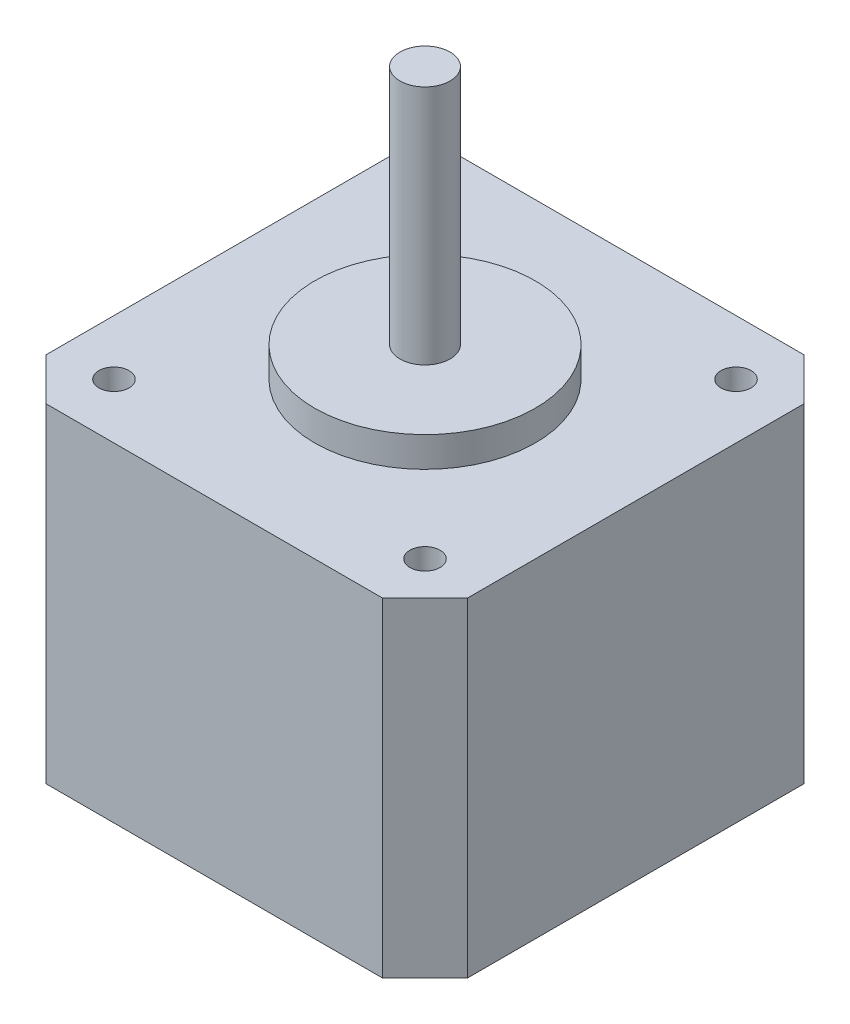
ISO-10303-21;
HEADER;
FILE_DESCRIPTION(('STEP AP214'),'2;1');
FILE_NAME('part.step','',(''),(''),'','','');
FILE_SCHEMA(('AUTOMOTIVE_DESIGN { 1 0 10303 214 1 1 1 1 }'));
ENDSEC;
DATA;
#1=APPLICATION_CONTEXT('core data for automotive mechanical design processes');
#2=APPLICATION_PROTOCOL_DEFINITION('international standard','automotive_design',2000,#1);
#3=PRODUCT_CONTEXT('',#1,'mechanical');
#4=PRODUCT('Part','Part','',(#3));
#5=PRODUCT_RELATED_PRODUCT_CATEGORY('part','',(#4));
#6=PRODUCT_DEFINITION_FORMATION('','',#4);
#7=PRODUCT_DEFINITION_CONTEXT('part definition',#1,'design');
#8=PRODUCT_DEFINITION('design','',#6,#7);
#9=PRODUCT_DEFINITION_SHAPE('','',#8);
#10=(LENGTH_UNIT() NAMED_UNIT(*) SI_UNIT(.MILLI.,.METRE.));
#11=(NAMED_UNIT(*) PLANE_ANGLE_UNIT() SI_UNIT($,.RADIAN.));
#12=(NAMED_UNIT(*) SI_UNIT($,.STERADIAN.) SOLID_ANGLE_UNIT());
#13=UNCERTAINTY_MEASURE_WITH_UNIT(LENGTH_MEASURE(1.E-05),#10,'distance_accuracy_value','');
#14=(GEOMETRIC_REPRESENTATION_CONTEXT(3) GLOBAL_UNCERTAINTY_ASSIGNED_CONTEXT((#13)) GLOBAL_UNIT_ASSIGNED_CONTEXT((#10,
#11,#12)) REPRESENTATION_CONTEXT('',''));
#15=CARTESIAN_POINT('',(0.,0.,0.));
#16=DIRECTION('',(0.,0.,1.));
#17=DIRECTION('',(1.,0.,0.));
#18=AXIS2_PLACEMENT_3D('',#15,#16,#17);
#19=CARTESIAN_POINT('',(-21.,32.8,-19.));
#20=DIRECTION('',(1.,0.,0.));
#21=DIRECTION('',(0.,0.,-1.));
#22=AXIS2_PLACEMENT_3D('',#19,#20,#21);
#23=PLANE('',#22);
#24=DIRECTION('',(0.,0.,1.));
#25=VECTOR('',#24,1.);
#26=CARTESIAN_POINT('',(-21.,0.,-19.));
#27=LINE('',#26,#25);
#28=CARTESIAN_POINT('',(-21.,0.,-19.));
#29=VERTEX_POINT('',#28);
#30=CARTESIAN_POINT('',(-21.,0.,16.76));
#31=VERTEX_POINT('',#30);
#32=EDGE_CURVE('E131',#29,#31,#27,.T.);
#33=ORIENTED_EDGE('',*,*,#32,.T.);
#34=DIRECTION('',(0.,-1.,0.));
#35=VECTOR('',#34,1.);
#36=CARTESIAN_POINT('',(-21.,32.8,16.76));
#37=LINE('',#36,#35);
#38=CARTESIAN_POINT('',(-21.,32.8,16.76));
#39=VERTEX_POINT('',#38);
#40=EDGE_CURVE('E35',#39,#31,#37,.T.);
#41=ORIENTED_EDGE('',*,*,#40,.F.);
#42=DIRECTION('',(0.,0.,1.));
#43=VECTOR('',#42,1.);
#44=CARTESIAN_POINT('',(-21.,32.8,-19.));
#45=LINE('',#44,#43);
#46=CARTESIAN_POINT('',(-21.,32.8,-19.));
#47=VERTEX_POINT('',#46);
#48=EDGE_CURVE('E146',#47,#39,#45,.T.);
#49=ORIENTED_EDGE('',*,*,#48,.F.);
#50=DIRECTION('',(0.,-1.,0.));
#51=VECTOR('',#50,1.);
#52=CARTESIAN_POINT('',(-21.,32.8,-19.));
#53=LINE('',#52,#51);
#54=EDGE_CURVE('E127',#47,#29,#53,.T.);
#55=ORIENTED_EDGE('',*,*,#54,.T.);
#56=EDGE_LOOP('',(#33,#41,#49,#55));
#57=FACE_BOUND('',#56,.T.);
#58=ADVANCED_FACE('F32',(#57),#23,.F.);
#59=CARTESIAN_POINT('',(-21.,32.8,16.76));
#60=DIRECTION('',(0.707106781186552,0.,-0.707106781186543));
#61=DIRECTION('',(-0.707106781186543,0.,-0.707106781186552));
#62=AXIS2_PLACEMENT_3D('',#59,#60,#61);
#63=PLANE('',#62);
#64=DIRECTION('',(0.707106781186543,0.,0.707106781186552));
#65=VECTOR('',#64,1.);
#66=CARTESIAN_POINT('',(-21.,0.,16.76));
#67=LINE('',#66,#65);
#68=CARTESIAN_POINT('',(-16.76,0.,21.));
#69=VERTEX_POINT('',#68);
#70=EDGE_CURVE('E134',#31,#69,#67,.T.);
#71=ORIENTED_EDGE('',*,*,#70,.T.);
#72=DIRECTION('',(0.,-1.,0.));
#73=VECTOR('',#72,1.);
#74=CARTESIAN_POINT('',(-16.76,32.8,21.));
#75=LINE('',#74,#73);
#76=CARTESIAN_POINT('',(-16.76,32.8,21.));
#77=VERTEX_POINT('',#76);
#78=EDGE_CURVE('E155',#77,#69,#75,.T.);
#79=ORIENTED_EDGE('',*,*,#78,.F.);
#80=DIRECTION('',(0.707106781186543,0.,0.707106781186552));
#81=VECTOR('',#80,1.);
#82=CARTESIAN_POINT('',(-21.,32.8,16.76));
#83=LINE('',#82,#81);
#84=EDGE_CURVE('E94',#39,#77,#83,.T.);
#85=ORIENTED_EDGE('',*,*,#84,.F.);
#86=ORIENTED_EDGE('',*,*,#40,.T.);
#87=EDGE_LOOP('',(#71,#79,#85,#86));
#88=FACE_BOUND('',#87,.T.);
#89=ADVANCED_FACE('F222',(#88),#63,.F.);
#90=CARTESIAN_POINT('',(-16.76,32.8,21.));
#91=DIRECTION('',(0.,0.,-1.));
#92=DIRECTION('',(-1.,0.,0.));
#93=AXIS2_PLACEMENT_3D('',#90,#91,#92);
#94=PLANE('',#93);
#95=DIRECTION('',(1.,0.,0.));
#96=VECTOR('',#95,1.);
#97=CARTESIAN_POINT('',(-16.76,0.,21.));
#98=LINE('',#97,#96);
#99=CARTESIAN_POINT('',(16.76,0.,21.));
#100=VERTEX_POINT('',#99);
#101=EDGE_CURVE('E137',#69,#100,#98,.T.);
#102=ORIENTED_EDGE('',*,*,#101,.T.);
#103=DIRECTION('',(0.,-1.,0.));
#104=VECTOR('',#103,1.);
#105=CARTESIAN_POINT('',(16.76,32.8,21.));
#106=LINE('',#105,#104);
#107=CARTESIAN_POINT('',(16.76,32.8,21.));
#108=VERTEX_POINT('',#107);
#109=EDGE_CURVE('E153',#108,#100,#106,.T.);
#110=ORIENTED_EDGE('',*,*,#109,.F.);
#111=DIRECTION('',(1.,0.,0.));
#112=VECTOR('',#111,1.);
#113=CARTESIAN_POINT('',(-16.76,32.8,21.));
#114=LINE('',#113,#112);
#115=EDGE_CURVE('E193',#77,#108,#114,.T.);
#116=ORIENTED_EDGE('',*,*,#115,.F.);
#117=ORIENTED_EDGE('',*,*,#78,.T.);
#118=EDGE_LOOP('',(#102,#110,#116,#117));
#119=FACE_BOUND('',#118,.T.);
#120=ADVANCED_FACE('F226',(#119),#94,.F.);
#121=CARTESIAN_POINT('',(21.,32.8,16.76));
#122=DIRECTION('',(-0.707106781186548,0.,-0.707106781186548));
#123=DIRECTION('',(-0.707106781186548,0.,0.707106781186548));
#124=AXIS2_PLACEMENT_3D('',#121,#122,#123);
#125=PLANE('',#124);
#126=DIRECTION('',(0.707106781186548,0.,-0.707106781186548));
#127=VECTOR('',#126,1.);
#128=CARTESIAN_POINT('',(21.,0.,16.76));
#129=LINE('',#128,#127);
#130=CARTESIAN_POINT('',(21.,0.,16.76));
#131=VERTEX_POINT('',#130);
#132=EDGE_CURVE('E139',#100,#131,#129,.T.);
#133=ORIENTED_EDGE('',*,*,#132,.T.);
#134=DIRECTION('',(0.,-1.,0.));
#135=VECTOR('',#134,1.);
#136=CARTESIAN_POINT('',(21.,32.8,16.76));
#137=LINE('',#136,#135);
#138=CARTESIAN_POINT('',(21.,32.8,16.76));
#139=VERTEX_POINT('',#138);
#140=EDGE_CURVE('E150',#139,#131,#137,.T.);
#141=ORIENTED_EDGE('',*,*,#140,.F.);
#142=DIRECTION('',(0.707106781186548,0.,-0.707106781186548));
#143=VECTOR('',#142,1.);
#144=CARTESIAN_POINT('',(21.,32.8,16.76));
#145=LINE('',#144,#143);
#146=EDGE_CURVE('E195',#108,#139,#145,.T.);
#147=ORIENTED_EDGE('',*,*,#146,.F.);
#148=ORIENTED_EDGE('',*,*,#109,.T.);
#149=EDGE_LOOP('',(#133,#141,#147,#148));
#150=FACE_BOUND('',#149,.T.);
#151=ADVANCED_FACE('F200',(#150),#125,.F.);
#152=CARTESIAN_POINT('',(21.,32.8,-16.76));
#153=DIRECTION('',(-1.,0.,0.));
#154=DIRECTION('',(0.,0.,1.));
#155=AXIS2_PLACEMENT_3D('',#152,#153,#154);
#156=PLANE('',#155);
#157=DIRECTION('',(0.,0.,-1.));
#158=VECTOR('',#157,1.);
#159=CARTESIAN_POINT('',(21.,0.,-16.76));
#160=LINE('',#159,#158);
#161=CARTESIAN_POINT('',(21.,0.,-16.76));
#162=VERTEX_POINT('',#161);
#163=EDGE_CURVE('E141',#131,#162,#160,.T.);
#164=ORIENTED_EDGE('',*,*,#163,.T.);
#165=DIRECTION('',(0.,-1.,0.));
#166=VECTOR('',#165,1.);
#167=CARTESIAN_POINT('',(21.,32.8,-16.76));
#168=LINE('',#167,#166);
#169=CARTESIAN_POINT('',(21.,32.8,-16.76));
#170=VERTEX_POINT('',#169);
#171=EDGE_CURVE('E122',#170,#162,#168,.T.);
#172=ORIENTED_EDGE('',*,*,#171,.F.);
#173=DIRECTION('',(0.,0.,-1.));
#174=VECTOR('',#173,1.);
#175=CARTESIAN_POINT('',(21.,32.8,-16.76));
#176=LINE('',#175,#174);
#177=EDGE_CURVE('E113',#139,#170,#176,.T.);
#178=ORIENTED_EDGE('',*,*,#177,.F.);
#179=ORIENTED_EDGE('',*,*,#140,.T.);
#180=EDGE_LOOP('',(#164,#172,#178,#179));
#181=FACE_BOUND('',#180,.T.);
#182=ADVANCED_FACE('F204',(#181),#156,.F.);
#183=CARTESIAN_POINT('',(16.76,32.8,-21.));
#184=DIRECTION('',(-0.707106781186548,0.,0.707106781186547));
#185=DIRECTION('',(0.707106781186547,0.,0.707106781186548));
#186=AXIS2_PLACEMENT_3D('',#183,#184,#185);
#187=PLANE('',#186);
#188=DIRECTION('',(-0.707106781186547,0.,-0.707106781186548));
#189=VECTOR('',#188,1.);
#190=CARTESIAN_POINT('',(16.76,0.,-21.));
#191=LINE('',#190,#189);
#192=CARTESIAN_POINT('',(16.76,0.,-21.));
#193=VERTEX_POINT('',#192);
#194=EDGE_CURVE('E121',#162,#193,#191,.T.);
#195=ORIENTED_EDGE('',*,*,#194,.T.);
#196=DIRECTION('',(0.,-1.,0.));
#197=VECTOR('',#196,1.);
#198=CARTESIAN_POINT('',(16.76,32.8,-21.));
#199=LINE('',#198,#197);
#200=CARTESIAN_POINT('',(16.76,32.8,-21.));
#201=VERTEX_POINT('',#200);
#202=EDGE_CURVE('E118',#201,#193,#199,.T.);
#203=ORIENTED_EDGE('',*,*,#202,.F.);
#204=DIRECTION('',(-0.707106781186547,0.,-0.707106781186548));
#205=VECTOR('',#204,1.);
#206=CARTESIAN_POINT('',(16.76,32.8,-21.));
#207=LINE('',#206,#205);
#208=EDGE_CURVE('E107',#170,#201,#207,.T.);
#209=ORIENTED_EDGE('',*,*,#208,.F.);
#210=ORIENTED_EDGE('',*,*,#171,.T.);
#211=EDGE_LOOP('',(#195,#203,#209,#210));
#212=FACE_BOUND('',#211,.T.);
#213=ADVANCED_FACE('F119',(#212),#187,.F.);
#214=CARTESIAN_POINT('',(-19.,32.8,-21.));
#215=DIRECTION('',(0.,0.,1.));
#216=DIRECTION('',(1.,0.,0.));
#217=AXIS2_PLACEMENT_3D('',#214,#215,#216);
#218=PLANE('',#217);
#219=DIRECTION('',(-1.,0.,0.));
#220=VECTOR('',#219,1.);
#221=CARTESIAN_POINT('',(-19.,0.,-21.));
#222=LINE('',#221,#220);
#223=CARTESIAN_POINT('',(-19.,0.,-21.));
#224=VERTEX_POINT('',#223);
#225=EDGE_CURVE('E79',#193,#224,#222,.T.);
#226=ORIENTED_EDGE('',*,*,#225,.T.);
#227=DIRECTION('',(0.,-1.,0.));
#228=VECTOR('',#227,1.);
#229=CARTESIAN_POINT('',(-19.,32.8,-21.));
#230=LINE('',#229,#228);
#231=CARTESIAN_POINT('',(-19.,32.8,-21.));
#232=VERTEX_POINT('',#231);
#233=EDGE_CURVE('E123',#232,#224,#230,.T.);
#234=ORIENTED_EDGE('',*,*,#233,.F.);
#235=DIRECTION('',(-1.,0.,0.));
#236=VECTOR('',#235,1.);
#237=CARTESIAN_POINT('',(-19.,32.8,-21.));
#238=LINE('',#237,#236);
#239=EDGE_CURVE('E111',#201,#232,#238,.T.);
#240=ORIENTED_EDGE('',*,*,#239,.F.);
#241=ORIENTED_EDGE('',*,*,#202,.T.);
#242=EDGE_LOOP('',(#226,#234,#240,#241));
#243=FACE_BOUND('',#242,.T.);
#244=ADVANCED_FACE('F125',(#243),#218,.F.);
#245=CARTESIAN_POINT('',(-19.,32.8,-21.));
#246=DIRECTION('',(0.707106781186547,0.,0.707106781186547));
#247=DIRECTION('',(0.707106781186547,0.,-0.707106781186547));
#248=AXIS2_PLACEMENT_3D('',#245,#246,#247);
#249=PLANE('',#248);
#250=DIRECTION('',(-0.707106781186548,0.,0.707106781186548));
#251=VECTOR('',#250,1.);
#252=CARTESIAN_POINT('',(-19.,0.,-21.));
#253=LINE('',#252,#251);
#254=EDGE_CURVE('E85',#224,#29,#253,.T.);
#255=ORIENTED_EDGE('',*,*,#254,.T.);
#256=ORIENTED_EDGE('',*,*,#54,.F.);
#257=DIRECTION('',(-0.707106781186548,0.,0.707106781186548));
#258=VECTOR('',#257,1.);
#259=CARTESIAN_POINT('',(-19.,32.8,-21.));
#260=LINE('',#259,#258);
#261=EDGE_CURVE('E50',#232,#47,#260,.T.);
#262=ORIENTED_EDGE('',*,*,#261,.F.);
#263=ORIENTED_EDGE('',*,*,#233,.T.);
#264=EDGE_LOOP('',(#255,#256,#262,#263));
#265=FACE_BOUND('',#264,.T.);
#266=ADVANCED_FACE('F210',(#265),#249,.F.);
#267=CARTESIAN_POINT('',(0.,32.8,0.));
#268=DIRECTION('',(0.,1.,0.));
#269=DIRECTION('',(0.,0.,1.));
#270=AXIS2_PLACEMENT_3D('',#267,#268,#269);
#271=PLANE('',#270);
#272=CARTESIAN_POINT('',(0.,32.8,0.));
#273=DIRECTION('',(0.,1.,0.));
#274=DIRECTION('',(0.,0.,1.));
#275=AXIS2_PLACEMENT_3D('',#272,#273,#274);
#276=CIRCLE('',#275,11.);
#277=CARTESIAN_POINT('',(0.,32.8,11.));
#278=VERTEX_POINT('',#277);
#279=EDGE_CURVE('E41',#278,#278,#276,.T.);
#280=ORIENTED_EDGE('',*,*,#279,.F.);
#281=EDGE_LOOP('',(#280));
#282=FACE_BOUND('',#281,.T.);
#283=CARTESIAN_POINT('',(-15.5,32.8,-15.5));
#284=DIRECTION('',(0.,1.,0.));
#285=DIRECTION('',(0.,0.,-1.));
#286=AXIS2_PLACEMENT_3D('',#283,#284,#285);
#287=CIRCLE('',#286,1.5);
#288=CARTESIAN_POINT('',(-15.5,32.8,-17.));
#289=VERTEX_POINT('',#288);
#290=EDGE_CURVE('E184',#289,#289,#287,.T.);
#291=ORIENTED_EDGE('',*,*,#290,.F.);
#292=EDGE_LOOP('',(#291));
#293=FACE_BOUND('',#292,.T.);
#294=CARTESIAN_POINT('',(-15.5,32.8,15.5));
#295=DIRECTION('',(0.,1.,0.));
#296=DIRECTION('',(0.,0.,1.));
#297=AXIS2_PLACEMENT_3D('',#294,#295,#296);
#298=CIRCLE('',#297,1.5);
#299=CARTESIAN_POINT('',(-15.5,32.8,17.));
#300=VERTEX_POINT('',#299);
#301=EDGE_CURVE('E178',#300,#300,#298,.T.);
#302=ORIENTED_EDGE('',*,*,#301,.F.);
#303=EDGE_LOOP('',(#302));
#304=FACE_BOUND('',#303,.T.);
#305=CARTESIAN_POINT('',(15.5,32.8,15.5));
#306=DIRECTION('',(0.,1.,0.));
#307=DIRECTION('',(0.,0.,-1.));
#308=AXIS2_PLACEMENT_3D('',#305,#306,#307);
#309=CIRCLE('',#308,1.5);
#310=CARTESIAN_POINT('',(15.5,32.8,14.));
#311=VERTEX_POINT('',#310);
#312=EDGE_CURVE('E172',#311,#311,#309,.T.);
#313=ORIENTED_EDGE('',*,*,#312,.F.);
#314=EDGE_LOOP('',(#313));
#315=FACE_BOUND('',#314,.T.);
#316=CARTESIAN_POINT('',(15.5,32.8,-15.5));
#317=DIRECTION('',(0.,1.,0.));
#318=DIRECTION('',(0.,0.,1.));
#319=AXIS2_PLACEMENT_3D('',#316,#317,#318);
#320=CIRCLE('',#319,1.5);
#321=CARTESIAN_POINT('',(15.5,32.8,-14.));
#322=VERTEX_POINT('',#321);
#323=EDGE_CURVE('E171',#322,#322,#320,.T.);
#324=ORIENTED_EDGE('',*,*,#323,.F.);
#325=EDGE_LOOP('',(#324));
#326=FACE_BOUND('',#325,.T.);
#327=ORIENTED_EDGE('',*,*,#48,.T.);
#328=ORIENTED_EDGE('',*,*,#84,.T.);
#329=ORIENTED_EDGE('',*,*,#115,.T.);
#330=ORIENTED_EDGE('',*,*,#146,.T.);
#331=ORIENTED_EDGE('',*,*,#177,.T.);
#332=ORIENTED_EDGE('',*,*,#208,.T.);
#333=ORIENTED_EDGE('',*,*,#239,.T.);
#334=ORIENTED_EDGE('',*,*,#261,.T.);
#335=EDGE_LOOP('',(#327,#328,#329,#330,#331,#332,#333,#334));
#336=FACE_BOUND('',#335,.T.);
#337=ADVANCED_FACE('F109',(#282,#293,#304,#315,#326,#336),#271,.T.);
#338=CARTESIAN_POINT('',(0.,0.,0.));
#339=DIRECTION('',(0.,1.,0.));
#340=DIRECTION('',(0.,0.,1.));
#341=AXIS2_PLACEMENT_3D('',#338,#339,#340);
#342=PLANE('',#341);
#343=ORIENTED_EDGE('',*,*,#32,.F.);
#344=ORIENTED_EDGE('',*,*,#254,.F.);
#345=ORIENTED_EDGE('',*,*,#225,.F.);
#346=ORIENTED_EDGE('',*,*,#194,.F.);
#347=ORIENTED_EDGE('',*,*,#163,.F.);
#348=ORIENTED_EDGE('',*,*,#132,.F.);
#349=ORIENTED_EDGE('',*,*,#101,.F.);
#350=ORIENTED_EDGE('',*,*,#70,.F.);
#351=EDGE_LOOP('',(#343,#344,#345,#346,#347,#348,#349,#350));
#352=FACE_BOUND('',#351,.T.);
#353=ADVANCED_FACE('F207',(#352),#342,.F.);
#354=CARTESIAN_POINT('',(15.5,22.8,-15.5));
#355=DIRECTION('',(0.,1.,0.));
#356=DIRECTION('',(0.,0.,1.));
#357=AXIS2_PLACEMENT_3D('',#354,#355,#356);
#358=CYLINDRICAL_SURFACE('',#357,1.5);
#359=CARTESIAN_POINT('',(15.5,22.8,-15.5));
#360=DIRECTION('',(0.,1.,0.));
#361=DIRECTION('',(0.,0.,1.));
#362=AXIS2_PLACEMENT_3D('',#359,#360,#361);
#363=CIRCLE('',#362,1.5);
#364=CARTESIAN_POINT('',(15.5,22.8,-14.));
#365=VERTEX_POINT('',#364);
#366=EDGE_CURVE('E135',#365,#365,#363,.T.);
#367=ORIENTED_EDGE('',*,*,#366,.F.);
#368=EDGE_LOOP('',(#367));
#369=FACE_BOUND('',#368,.T.);
#370=ORIENTED_EDGE('',*,*,#323,.T.);
#371=EDGE_LOOP('',(#370));
#372=FACE_BOUND('',#371,.T.);
#373=ADVANCED_FACE('F259',(#369,#372),#358,.F.);
#374=CARTESIAN_POINT('',(15.5,22.8,-15.5));
#375=DIRECTION('',(0.,1.,0.));
#376=DIRECTION('',(0.,0.,1.));
#377=AXIS2_PLACEMENT_3D('',#374,#375,#376);
#378=PLANE('',#377);
#379=ORIENTED_EDGE('',*,*,#366,.T.);
#380=EDGE_LOOP('',(#379));
#381=FACE_BOUND('',#380,.T.);
#382=ADVANCED_FACE('F267',(#381),#378,.T.);
#383=CARTESIAN_POINT('',(15.5,22.8,15.5));
#384=DIRECTION('',(0.,1.,0.));
#385=DIRECTION('',(0.,0.,1.));
#386=AXIS2_PLACEMENT_3D('',#383,#384,#385);
#387=CYLINDRICAL_SURFACE('',#386,1.5);
#388=CARTESIAN_POINT('',(15.5,22.8,15.5));
#389=DIRECTION('',(0.,1.,0.));
#390=DIRECTION('',(0.,0.,-1.));
#391=AXIS2_PLACEMENT_3D('',#388,#389,#390);
#392=CIRCLE('',#391,1.5);
#393=CARTESIAN_POINT('',(15.5,22.8,14.));
#394=VERTEX_POINT('',#393);
#395=EDGE_CURVE('E168',#394,#394,#392,.T.);
#396=ORIENTED_EDGE('',*,*,#395,.F.);
#397=EDGE_LOOP('',(#396));
#398=FACE_BOUND('',#397,.T.);
#399=ORIENTED_EDGE('',*,*,#312,.T.);
#400=EDGE_LOOP('',(#399));
#401=FACE_BOUND('',#400,.T.);
#402=ADVANCED_FACE('F277',(#398,#401),#387,.F.);
#403=CARTESIAN_POINT('',(15.5,22.8,15.5));
#404=DIRECTION('',(0.,-1.,0.));
#405=DIRECTION('',(0.,0.,-1.));
#406=AXIS2_PLACEMENT_3D('',#403,#404,#405);
#407=PLANE('',#406);
#408=ORIENTED_EDGE('',*,*,#395,.T.);
#409=EDGE_LOOP('',(#408));
#410=FACE_BOUND('',#409,.T.);
#411=ADVANCED_FACE('F287',(#410),#407,.F.);
#412=CARTESIAN_POINT('',(-15.5,22.8,15.5));
#413=DIRECTION('',(0.,1.,0.));
#414=DIRECTION('',(0.,0.,1.));
#415=AXIS2_PLACEMENT_3D('',#412,#413,#414);
#416=CYLINDRICAL_SURFACE('',#415,1.5);
#417=CARTESIAN_POINT('',(-15.5,22.8,15.5));
#418=DIRECTION('',(0.,1.,0.));
#419=DIRECTION('',(0.,0.,1.));
#420=AXIS2_PLACEMENT_3D('',#417,#418,#419);
#421=CIRCLE('',#420,1.5);
#422=CARTESIAN_POINT('',(-15.5,22.8,17.));
#423=VERTEX_POINT('',#422);
#424=EDGE_CURVE('E175',#423,#423,#421,.T.);
#425=ORIENTED_EDGE('',*,*,#424,.F.);
#426=EDGE_LOOP('',(#425));
#427=FACE_BOUND('',#426,.T.);
#428=ORIENTED_EDGE('',*,*,#301,.T.);
#429=EDGE_LOOP('',(#428));
#430=FACE_BOUND('',#429,.T.);
#431=ADVANCED_FACE('F297',(#427,#430),#416,.F.);
#432=CARTESIAN_POINT('',(-15.5,22.8,15.5));
#433=DIRECTION('',(0.,1.,0.));
#434=DIRECTION('',(0.,0.,1.));
#435=AXIS2_PLACEMENT_3D('',#432,#433,#434);
#436=PLANE('',#435);
#437=ORIENTED_EDGE('',*,*,#424,.T.);
#438=EDGE_LOOP('',(#437));
#439=FACE_BOUND('',#438,.T.);
#440=ADVANCED_FACE('F307',(#439),#436,.T.);
#441=CARTESIAN_POINT('',(-15.5,22.8,-15.5));
#442=DIRECTION('',(0.,1.,0.));
#443=DIRECTION('',(0.,0.,1.));
#444=AXIS2_PLACEMENT_3D('',#441,#442,#443);
#445=CYLINDRICAL_SURFACE('',#444,1.5);
#446=CARTESIAN_POINT('',(-15.5,22.8,-15.5));
#447=DIRECTION('',(0.,1.,0.));
#448=DIRECTION('',(0.,0.,-1.));
#449=AXIS2_PLACEMENT_3D('',#446,#447,#448);
#450=CIRCLE('',#449,1.5);
#451=CARTESIAN_POINT('',(-15.5,22.8,-17.));
#452=VERTEX_POINT('',#451);
#453=EDGE_CURVE('E181',#452,#452,#450,.T.);
#454=ORIENTED_EDGE('',*,*,#453,.F.);
#455=EDGE_LOOP('',(#454));
#456=FACE_BOUND('',#455,.T.);
#457=ORIENTED_EDGE('',*,*,#290,.T.);
#458=EDGE_LOOP('',(#457));
#459=FACE_BOUND('',#458,.T.);
#460=ADVANCED_FACE('F317',(#456,#459),#445,.F.);
#461=CARTESIAN_POINT('',(-15.5,22.8,-15.5));
#462=DIRECTION('',(0.,-1.,0.));
#463=DIRECTION('',(0.,0.,-1.));
#464=AXIS2_PLACEMENT_3D('',#461,#462,#463);
#465=PLANE('',#464);
#466=ORIENTED_EDGE('',*,*,#453,.T.);
#467=EDGE_LOOP('',(#466));
#468=FACE_BOUND('',#467,.T.);
#469=ADVANCED_FACE('F327',(#468),#465,.F.);
#470=CARTESIAN_POINT('',(0.,35.8,0.));
#471=DIRECTION('',(0.,-1.,0.));
#472=DIRECTION('',(0.,0.,-1.));
#473=AXIS2_PLACEMENT_3D('',#470,#471,#472);
#474=CYLINDRICAL_SURFACE('',#473,11.);
#475=CARTESIAN_POINT('',(0.,35.8,0.));
#476=DIRECTION('',(0.,1.,0.));
#477=DIRECTION('',(0.,0.,1.));
#478=AXIS2_PLACEMENT_3D('',#475,#476,#477);
#479=CIRCLE('',#478,11.);
#480=CARTESIAN_POINT('',(0.,35.8,11.));
#481=VERTEX_POINT('',#480);
#482=EDGE_CURVE('E167',#481,#481,#479,.T.);
#483=ORIENTED_EDGE('',*,*,#482,.F.);
#484=EDGE_LOOP('',(#483));
#485=FACE_BOUND('',#484,.T.);
#486=ORIENTED_EDGE('',*,*,#279,.T.);
#487=EDGE_LOOP('',(#486));
#488=FACE_BOUND('',#487,.T.);
#489=ADVANCED_FACE('F337',(#485,#488),#474,.T.);
#490=CARTESIAN_POINT('',(0.,35.8,0.));
#491=DIRECTION('',(0.,1.,0.));
#492=DIRECTION('',(0.,0.,1.));
#493=AXIS2_PLACEMENT_3D('',#490,#491,#492);
#494=PLANE('',#493);
#495=CARTESIAN_POINT('',(0.,35.8,0.));
#496=DIRECTION('',(0.,1.,0.));
#497=DIRECTION('',(0.,0.,1.));
#498=AXIS2_PLACEMENT_3D('',#495,#496,#497);
#499=CIRCLE('',#498,2.5);
#500=CARTESIAN_POINT('',(0.,35.8,2.5));
#501=VERTEX_POINT('',#500);
#502=EDGE_CURVE('E11',#501,#501,#499,.T.);
#503=ORIENTED_EDGE('',*,*,#502,.F.);
#504=EDGE_LOOP('',(#503));
#505=FACE_BOUND('',#504,.T.);
#506=ORIENTED_EDGE('',*,*,#482,.T.);
#507=EDGE_LOOP('',(#506));
#508=FACE_BOUND('',#507,.T.);
#509=ADVANCED_FACE('F352',(#505,#508),#494,.T.);
#510=CARTESIAN_POINT('',(0.,59.8,0.));
#511=DIRECTION('',(0.,-1.,0.));
#512=DIRECTION('',(0.,0.,-1.));
#513=AXIS2_PLACEMENT_3D('',#510,#511,#512);
#514=CYLINDRICAL_SURFACE('',#513,2.5);
#515=CARTESIAN_POINT('',(0.,59.8,0.));
#516=DIRECTION('',(0.,1.,0.));
#517=DIRECTION('',(0.,0.,1.));
#518=AXIS2_PLACEMENT_3D('',#515,#516,#517);
#519=CIRCLE('',#518,2.5);
#520=CARTESIAN_POINT('',(0.,59.8,2.5));
#521=VERTEX_POINT('',#520);
#522=EDGE_CURVE('E388',#521,#521,#519,.T.);
#523=ORIENTED_EDGE('',*,*,#522,.F.);
#524=EDGE_LOOP('',(#523));
#525=FACE_BOUND('',#524,.T.);
#526=ORIENTED_EDGE('',*,*,#502,.T.);
#527=EDGE_LOOP('',(#526));
#528=FACE_BOUND('',#527,.T.);
#529=ADVANCED_FACE('F362',(#525,#528),#514,.T.);
#530=CARTESIAN_POINT('',(0.,59.8,0.));
#531=DIRECTION('',(0.,1.,0.));
#532=DIRECTION('',(0.,0.,1.));
#533=AXIS2_PLACEMENT_3D('',#530,#531,#532);
#534=PLANE('',#533);
#535=ORIENTED_EDGE('',*,*,#522,.T.);
#536=EDGE_LOOP('',(#535));
#537=FACE_BOUND('',#536,.T.);
#538=ADVANCED_FACE('F372',(#537),#534,.T.);
#539=CLOSED_SHELL('',(#58,#89,#120,#151,#182,#213,#244,#266,#337,#353,#373,#382,#402,#411,#431,
#440,#460,#469,#489,#509,#529,#538));
#540=MANIFOLD_SOLID_BREP('B2',#539);
#541=ADVANCED_BREP_SHAPE_REPRESENTATION('',(#18,#540),#14);
#542=SHAPE_DEFINITION_REPRESENTATION(#9,#541);
ENDSEC;
END-ISO-10303-21;
